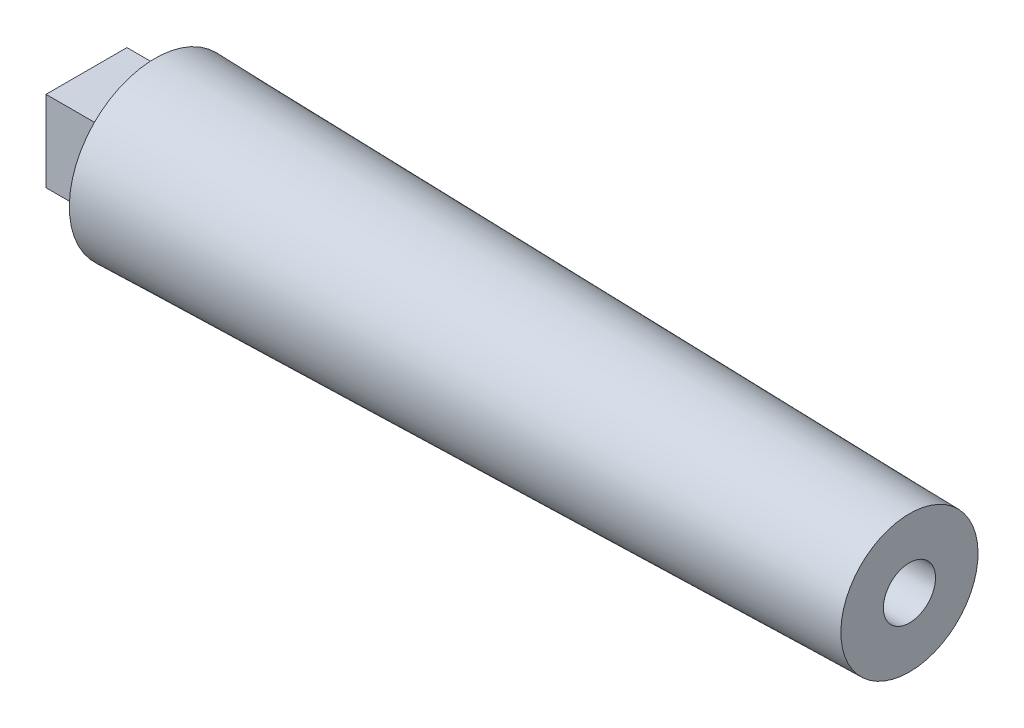
ISO-10303-21;
HEADER;
FILE_DESCRIPTION(('STEP AP214'),'2;1');
FILE_NAME('part.step','',(''),(''),'','','');
FILE_SCHEMA(('AUTOMOTIVE_DESIGN { 1 0 10303 214 1 1 1 1 }'));
ENDSEC;
DATA;
#1=APPLICATION_CONTEXT('core data for automotive mechanical design processes');
#2=APPLICATION_PROTOCOL_DEFINITION('international standard','automotive_design',2000,#1);
#3=PRODUCT_CONTEXT('',#1,'mechanical');
#4=PRODUCT('Part','Part','',(#3));
#5=PRODUCT_RELATED_PRODUCT_CATEGORY('part','',(#4));
#6=PRODUCT_DEFINITION_FORMATION('','',#4);
#7=PRODUCT_DEFINITION_CONTEXT('part definition',#1,'design');
#8=PRODUCT_DEFINITION('design','',#6,#7);
#9=PRODUCT_DEFINITION_SHAPE('','',#8);
#10=(LENGTH_UNIT() NAMED_UNIT(*) SI_UNIT(.MILLI.,.METRE.));
#11=(NAMED_UNIT(*) PLANE_ANGLE_UNIT() SI_UNIT($,.RADIAN.));
#12=(NAMED_UNIT(*) SI_UNIT($,.STERADIAN.) SOLID_ANGLE_UNIT());
#13=UNCERTAINTY_MEASURE_WITH_UNIT(LENGTH_MEASURE(1.E-05),#10,'distance_accuracy_value','');
#14=(GEOMETRIC_REPRESENTATION_CONTEXT(3) GLOBAL_UNCERTAINTY_ASSIGNED_CONTEXT((#13)) GLOBAL_UNIT_ASSIGNED_CONTEXT((#10,
#11,#12)) REPRESENTATION_CONTEXT('',''));
#15=CARTESIAN_POINT('',(0.,0.,0.));
#16=DIRECTION('',(0.,0.,1.));
#17=DIRECTION('',(1.,0.,0.));
#18=AXIS2_PLACEMENT_3D('',#15,#16,#17);
#19=CARTESIAN_POINT('',(12.7,12.7,0.));
#20=DIRECTION('',(1.,0.,0.));
#21=DIRECTION('',(0.,1.,0.));
#22=AXIS2_PLACEMENT_3D('',#19,#20,#21);
#23=PLANE('',#22);
#24=CARTESIAN_POINT('',(12.7,0.,0.));
#25=DIRECTION('',(-1.,0.,0.));
#26=DIRECTION('',(0.,-1.,0.));
#27=AXIS2_PLACEMENT_3D('',#24,#25,#26);
#28=CIRCLE('',#27,15.875);
#29=CARTESIAN_POINT('',(12.7,-15.875,0.));
#30=VERTEX_POINT('',#29);
#31=EDGE_CURVE('E42',#30,#30,#28,.T.);
#32=ORIENTED_EDGE('',*,*,#31,.T.);
#33=EDGE_LOOP('',(#32));
#34=FACE_BOUND('',#33,.T.);
#35=DIRECTION('',(0.,-1.,0.));
#36=VECTOR('',#35,1.);
#37=CARTESIAN_POINT('',(12.7,-7.493,-7.493));
#38=LINE('',#37,#36);
#39=CARTESIAN_POINT('',(12.7,7.493,-7.493));
#40=VERTEX_POINT('',#39);
#41=CARTESIAN_POINT('',(12.7,-7.493,-7.493));
#42=VERTEX_POINT('',#41);
#43=EDGE_CURVE('E95',#40,#42,#38,.T.);
#44=ORIENTED_EDGE('',*,*,#43,.F.);
#45=DIRECTION('',(0.,0.,-1.));
#46=VECTOR('',#45,1.);
#47=CARTESIAN_POINT('',(12.7,7.493,7.493));
#48=LINE('',#47,#46);
#49=CARTESIAN_POINT('',(12.7,7.493,7.493));
#50=VERTEX_POINT('',#49);
#51=EDGE_CURVE('E92',#50,#40,#48,.T.);
#52=ORIENTED_EDGE('',*,*,#51,.F.);
#53=DIRECTION('',(0.,1.,0.));
#54=VECTOR('',#53,1.);
#55=CARTESIAN_POINT('',(12.7,-7.493,7.493));
#56=LINE('',#55,#54);
#57=CARTESIAN_POINT('',(12.7,-7.493,7.493));
#58=VERTEX_POINT('',#57);
#59=EDGE_CURVE('E54',#58,#50,#56,.T.);
#60=ORIENTED_EDGE('',*,*,#59,.F.);
#61=DIRECTION('',(0.,0.,1.));
#62=VECTOR('',#61,1.);
#63=CARTESIAN_POINT('',(12.7,-7.493,7.493));
#64=LINE('',#63,#62);
#65=EDGE_CURVE('E49',#42,#58,#64,.T.);
#66=ORIENTED_EDGE('',*,*,#65,.F.);
#67=EDGE_LOOP('',(#44,#52,#60,#66));
#68=FACE_BOUND('',#67,.T.);
#69=ADVANCED_FACE('F34',(#34,#68),#23,.F.);
#70=CARTESIAN_POINT('',(152.4,12.7,0.));
#71=DIRECTION('',(-1.,0.,0.));
#72=DIRECTION('',(0.,-1.,0.));
#73=AXIS2_PLACEMENT_3D('',#70,#71,#72);
#74=PLANE('',#73);
#75=CARTESIAN_POINT('',(152.4,0.,0.));
#76=DIRECTION('',(1.,0.,0.));
#77=DIRECTION('',(0.,0.,-1.));
#78=AXIS2_PLACEMENT_3D('',#75,#76,#77);
#79=CIRCLE('',#78,4.826);
#80=CARTESIAN_POINT('',(152.4,0.,-4.826));
#81=VERTEX_POINT('',#80);
#82=EDGE_CURVE('E96',#81,#81,#79,.T.);
#83=ORIENTED_EDGE('',*,*,#82,.F.);
#84=EDGE_LOOP('',(#83));
#85=FACE_BOUND('',#84,.T.);
#86=CARTESIAN_POINT('',(152.4,0.,0.));
#87=DIRECTION('',(-1.,0.,0.));
#88=DIRECTION('',(0.,-1.,0.));
#89=AXIS2_PLACEMENT_3D('',#86,#87,#88);
#90=CIRCLE('',#89,12.7);
#91=CARTESIAN_POINT('',(152.4,-12.7,0.));
#92=VERTEX_POINT('',#91);
#93=EDGE_CURVE('E11',#92,#92,#90,.T.);
#94=ORIENTED_EDGE('',*,*,#93,.F.);
#95=EDGE_LOOP('',(#94));
#96=FACE_BOUND('',#95,.T.);
#97=ADVANCED_FACE('F36',(#85,#96),#74,.F.);
#98=CARTESIAN_POINT('',(152.4,0.,0.));
#99=DIRECTION('',(-1.,0.,0.));
#100=DIRECTION('',(0.,-1.,0.));
#101=AXIS2_PLACEMENT_3D('',#98,#99,#100);
#102=CONICAL_SURFACE('',#101,12.7,0.0227233608416411);
#103=ORIENTED_EDGE('',*,*,#31,.F.);
#104=EDGE_LOOP('',(#103));
#105=FACE_BOUND('',#104,.T.);
#106=ORIENTED_EDGE('',*,*,#93,.T.);
#107=EDGE_LOOP('',(#106));
#108=FACE_BOUND('',#107,.T.);
#109=ADVANCED_FACE('F110',(#105,#108),#102,.T.);
#110=CARTESIAN_POINT('',(127.,0.,0.));
#111=DIRECTION('',(1.,0.,0.));
#112=DIRECTION('',(0.,0.,-1.));
#113=AXIS2_PLACEMENT_3D('',#110,#111,#112);
#114=CYLINDRICAL_SURFACE('',#113,4.826);
#115=CARTESIAN_POINT('',(127.,0.,0.));
#116=DIRECTION('',(1.,0.,0.));
#117=DIRECTION('',(0.,0.,-1.));
#118=AXIS2_PLACEMENT_3D('',#115,#116,#117);
#119=CIRCLE('',#118,4.826);
#120=CARTESIAN_POINT('',(127.,0.,-4.826));
#121=VERTEX_POINT('',#120);
#122=EDGE_CURVE('E99',#121,#121,#119,.T.);
#123=ORIENTED_EDGE('',*,*,#122,.F.);
#124=EDGE_LOOP('',(#123));
#125=FACE_BOUND('',#124,.T.);
#126=ORIENTED_EDGE('',*,*,#82,.T.);
#127=EDGE_LOOP('',(#126));
#128=FACE_BOUND('',#127,.T.);
#129=ADVANCED_FACE('F113',(#125,#128),#114,.F.);
#130=CARTESIAN_POINT('',(127.,0.,0.));
#131=DIRECTION('',(1.,0.,0.));
#132=DIRECTION('',(0.,0.,-1.));
#133=AXIS2_PLACEMENT_3D('',#130,#131,#132);
#134=PLANE('',#133);
#135=ORIENTED_EDGE('',*,*,#122,.T.);
#136=EDGE_LOOP('',(#135));
#137=FACE_BOUND('',#136,.T.);
#138=ADVANCED_FACE('F125',(#137),#134,.T.);
#139=CARTESIAN_POINT('',(0.,-7.493,-7.493));
#140=DIRECTION('',(0.,0.,1.));
#141=DIRECTION('',(1.,0.,0.));
#142=AXIS2_PLACEMENT_3D('',#139,#140,#141);
#143=PLANE('',#142);
#144=ORIENTED_EDGE('',*,*,#43,.T.);
#145=DIRECTION('',(1.,0.,0.));
#146=VECTOR('',#145,1.);
#147=CARTESIAN_POINT('',(0.,-7.493,-7.493));
#148=LINE('',#147,#146);
#149=CARTESIAN_POINT('',(0.,-7.493,-7.493));
#150=VERTEX_POINT('',#149);
#151=EDGE_CURVE('E76',#150,#42,#148,.T.);
#152=ORIENTED_EDGE('',*,*,#151,.F.);
#153=DIRECTION('',(0.,-1.,0.));
#154=VECTOR('',#153,1.);
#155=CARTESIAN_POINT('',(0.,-7.493,-7.493));
#156=LINE('',#155,#154);
#157=CARTESIAN_POINT('',(0.,7.493,-7.493));
#158=VERTEX_POINT('',#157);
#159=EDGE_CURVE('E83',#158,#150,#156,.T.);
#160=ORIENTED_EDGE('',*,*,#159,.F.);
#161=DIRECTION('',(1.,0.,0.));
#162=VECTOR('',#161,1.);
#163=CARTESIAN_POINT('',(0.,7.493,-7.493));
#164=LINE('',#163,#162);
#165=EDGE_CURVE('E211',#158,#40,#164,.T.);
#166=ORIENTED_EDGE('',*,*,#165,.T.);
#167=EDGE_LOOP('',(#144,#152,#160,#166));
#168=FACE_BOUND('',#167,.T.);
#169=ADVANCED_FACE('F94',(#168),#143,.F.);
#170=CARTESIAN_POINT('',(0.,-7.493,7.493));
#171=DIRECTION('',(0.,1.,0.));
#172=DIRECTION('',(0.,0.,1.));
#173=AXIS2_PLACEMENT_3D('',#170,#171,#172);
#174=PLANE('',#173);
#175=ORIENTED_EDGE('',*,*,#65,.T.);
#176=DIRECTION('',(1.,0.,0.));
#177=VECTOR('',#176,1.);
#178=CARTESIAN_POINT('',(0.,-7.493,7.493));
#179=LINE('',#178,#177);
#180=CARTESIAN_POINT('',(0.,-7.493,7.493));
#181=VERTEX_POINT('',#180);
#182=EDGE_CURVE('E79',#181,#58,#179,.T.);
#183=ORIENTED_EDGE('',*,*,#182,.F.);
#184=DIRECTION('',(0.,0.,1.));
#185=VECTOR('',#184,1.);
#186=CARTESIAN_POINT('',(0.,-7.493,7.493));
#187=LINE('',#186,#185);
#188=EDGE_CURVE('E72',#150,#181,#187,.T.);
#189=ORIENTED_EDGE('',*,*,#188,.F.);
#190=ORIENTED_EDGE('',*,*,#151,.T.);
#191=EDGE_LOOP('',(#175,#183,#189,#190));
#192=FACE_BOUND('',#191,.T.);
#193=ADVANCED_FACE('F74',(#192),#174,.F.);
#194=CARTESIAN_POINT('',(0.,-7.493,7.493));
#195=DIRECTION('',(0.,0.,-1.));
#196=DIRECTION('',(-1.,0.,0.));
#197=AXIS2_PLACEMENT_3D('',#194,#195,#196);
#198=PLANE('',#197);
#199=ORIENTED_EDGE('',*,*,#59,.T.);
#200=DIRECTION('',(1.,0.,0.));
#201=VECTOR('',#200,1.);
#202=CARTESIAN_POINT('',(0.,7.493,7.493));
#203=LINE('',#202,#201);
#204=CARTESIAN_POINT('',(0.,7.493,7.493));
#205=VERTEX_POINT('',#204);
#206=EDGE_CURVE('E101',#205,#50,#203,.T.);
#207=ORIENTED_EDGE('',*,*,#206,.F.);
#208=DIRECTION('',(0.,1.,0.));
#209=VECTOR('',#208,1.);
#210=CARTESIAN_POINT('',(0.,-7.493,7.493));
#211=LINE('',#210,#209);
#212=EDGE_CURVE('E82',#181,#205,#211,.T.);
#213=ORIENTED_EDGE('',*,*,#212,.F.);
#214=ORIENTED_EDGE('',*,*,#182,.T.);
#215=EDGE_LOOP('',(#199,#207,#213,#214));
#216=FACE_BOUND('',#215,.T.);
#217=ADVANCED_FACE('F139',(#216),#198,.F.);
#218=CARTESIAN_POINT('',(0.,7.493,7.493));
#219=DIRECTION('',(0.,-1.,0.));
#220=DIRECTION('',(0.,0.,-1.));
#221=AXIS2_PLACEMENT_3D('',#218,#219,#220);
#222=PLANE('',#221);
#223=ORIENTED_EDGE('',*,*,#51,.T.);
#224=ORIENTED_EDGE('',*,*,#165,.F.);
#225=DIRECTION('',(0.,0.,-1.));
#226=VECTOR('',#225,1.);
#227=CARTESIAN_POINT('',(0.,7.493,7.493));
#228=LINE('',#227,#226);
#229=EDGE_CURVE('E88',#205,#158,#228,.T.);
#230=ORIENTED_EDGE('',*,*,#229,.F.);
#231=ORIENTED_EDGE('',*,*,#206,.T.);
#232=EDGE_LOOP('',(#223,#224,#230,#231));
#233=FACE_BOUND('',#232,.T.);
#234=ADVANCED_FACE('F142',(#233),#222,.F.);
#235=CARTESIAN_POINT('',(0.,0.,0.));
#236=DIRECTION('',(-1.,0.,0.));
#237=DIRECTION('',(0.,0.,1.));
#238=AXIS2_PLACEMENT_3D('',#235,#236,#237);
#239=PLANE('',#238);
#240=ORIENTED_EDGE('',*,*,#159,.T.);
#241=ORIENTED_EDGE('',*,*,#188,.T.);
#242=ORIENTED_EDGE('',*,*,#212,.T.);
#243=ORIENTED_EDGE('',*,*,#229,.T.);
#244=EDGE_LOOP('',(#240,#241,#242,#243));
#245=FACE_BOUND('',#244,.T.);
#246=ADVANCED_FACE('F86',(#245),#239,.T.);
#247=CLOSED_SHELL('',(#69,#97,#109,#129,#138,#169,#193,#217,#234,#246));
#248=MANIFOLD_SOLID_BREP('B2',#247);
#249=ADVANCED_BREP_SHAPE_REPRESENTATION('',(#18,#248),#14);
#250=SHAPE_DEFINITION_REPRESENTATION(#9,#249);
ENDSEC;
END-ISO-10303-21;
